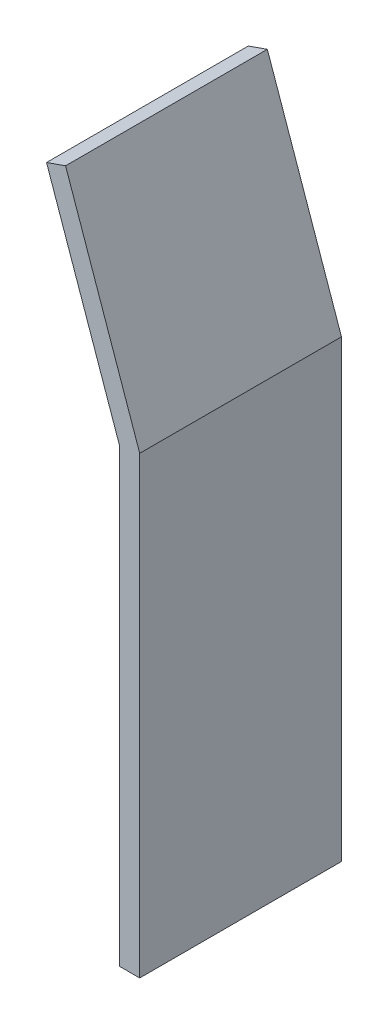
ISO-10303-21;
HEADER;
FILE_DESCRIPTION(('STEP AP214'),'2;1');
FILE_NAME('part.step','',(''),(''),'','','');
FILE_SCHEMA(('AUTOMOTIVE_DESIGN { 1 0 10303 214 1 1 1 1 }'));
ENDSEC;
DATA;
#1=APPLICATION_CONTEXT('core data for automotive mechanical design processes');
#2=APPLICATION_PROTOCOL_DEFINITION('international standard','automotive_design',2000,#1);
#3=PRODUCT_CONTEXT('',#1,'mechanical');
#4=PRODUCT('Part','Part','',(#3));
#5=PRODUCT_RELATED_PRODUCT_CATEGORY('part','',(#4));
#6=PRODUCT_DEFINITION_FORMATION('','',#4);
#7=PRODUCT_DEFINITION_CONTEXT('part definition',#1,'design');
#8=PRODUCT_DEFINITION('design','',#6,#7);
#9=PRODUCT_DEFINITION_SHAPE('','',#8);
#10=(LENGTH_UNIT() NAMED_UNIT(*) SI_UNIT(.MILLI.,.METRE.));
#11=(NAMED_UNIT(*) PLANE_ANGLE_UNIT() SI_UNIT($,.RADIAN.));
#12=(NAMED_UNIT(*) SI_UNIT($,.STERADIAN.) SOLID_ANGLE_UNIT());
#13=UNCERTAINTY_MEASURE_WITH_UNIT(LENGTH_MEASURE(1.E-05),#10,'distance_accuracy_value','');
#14=(GEOMETRIC_REPRESENTATION_CONTEXT(3) GLOBAL_UNCERTAINTY_ASSIGNED_CONTEXT((#13)) GLOBAL_UNIT_ASSIGNED_CONTEXT((#10,
#11,#12)) REPRESENTATION_CONTEXT('',''));
#15=CARTESIAN_POINT('',(0.,0.,0.));
#16=DIRECTION('',(0.,0.,1.));
#17=DIRECTION('',(1.,0.,0.));
#18=AXIS2_PLACEMENT_3D('',#15,#16,#17);
#19=CARTESIAN_POINT('',(-72.3633279223742,206.868688718228,200.));
#20=DIRECTION('',(0.943916265368806,0.330184923902054,0.));
#21=DIRECTION('',(-0.330184923902054,0.943916265368806,0.));
#22=AXIS2_PLACEMENT_3D('',#19,#20,#21);
#23=PLANE('',#22);
#24=DIRECTION('',(0.330184923902054,-0.943916265368806,0.));
#25=VECTOR('',#24,1.);
#26=CARTESIAN_POINT('',(-72.3633279223742,206.868688718228,0.));
#27=LINE('',#26,#25);
#28=CARTESIAN_POINT('',(-72.3633279223742,206.868688718228,0.));
#29=VERTEX_POINT('',#28);
#30=CARTESIAN_POINT('',(0.,0.,0.));
#31=VERTEX_POINT('',#30);
#32=EDGE_CURVE('E134',#29,#31,#27,.T.);
#33=ORIENTED_EDGE('',*,*,#32,.T.);
#34=DIRECTION('',(0.,0.,-1.));
#35=VECTOR('',#34,1.);
#36=CARTESIAN_POINT('',(0.,0.,200.));
#37=LINE('',#36,#35);
#38=CARTESIAN_POINT('',(0.,0.,200.));
#39=VERTEX_POINT('',#38);
#40=EDGE_CURVE('E11',#39,#31,#37,.T.);
#41=ORIENTED_EDGE('',*,*,#40,.F.);
#42=DIRECTION('',(0.330184923902054,-0.943916265368806,0.));
#43=VECTOR('',#42,1.);
#44=CARTESIAN_POINT('',(-72.3633279223742,206.868688718228,200.));
#45=LINE('',#44,#43);
#46=CARTESIAN_POINT('',(-72.3633279223742,206.868688718228,200.));
#47=VERTEX_POINT('',#46);
#48=EDGE_CURVE('E150',#47,#39,#45,.T.);
#49=ORIENTED_EDGE('',*,*,#48,.F.);
#50=DIRECTION('',(0.,0.,-1.));
#51=VECTOR('',#50,1.);
#52=CARTESIAN_POINT('',(-72.3633279223742,206.868688718228,200.));
#53=LINE('',#52,#51);
#54=EDGE_CURVE('E130',#47,#29,#53,.T.);
#55=ORIENTED_EDGE('',*,*,#54,.T.);
#56=EDGE_LOOP('',(#33,#41,#49,#55));
#57=FACE_BOUND('',#56,.T.);
#58=ADVANCED_FACE('F45',(#57),#23,.F.);
#59=CARTESIAN_POINT('',(0.,0.,200.));
#60=DIRECTION('',(1.,0.,0.));
#61=DIRECTION('',(0.,1.,0.));
#62=AXIS2_PLACEMENT_3D('',#59,#60,#61);
#63=PLANE('',#62);
#64=DIRECTION('',(0.,-1.,0.));
#65=VECTOR('',#64,1.);
#66=CARTESIAN_POINT('',(0.,0.,0.));
#67=LINE('',#66,#65);
#68=CARTESIAN_POINT('',(0.,-447.,0.));
#69=VERTEX_POINT('',#68);
#70=EDGE_CURVE('E138',#31,#69,#67,.T.);
#71=ORIENTED_EDGE('',*,*,#70,.T.);
#72=DIRECTION('',(0.,0.,-1.));
#73=VECTOR('',#72,1.);
#74=CARTESIAN_POINT('',(0.,-447.,200.));
#75=LINE('',#74,#73);
#76=CARTESIAN_POINT('',(0.,-447.,200.));
#77=VERTEX_POINT('',#76);
#78=EDGE_CURVE('E54',#77,#69,#75,.T.);
#79=ORIENTED_EDGE('',*,*,#78,.F.);
#80=DIRECTION('',(0.,-1.,0.));
#81=VECTOR('',#80,1.);
#82=CARTESIAN_POINT('',(0.,0.,200.));
#83=LINE('',#82,#81);
#84=EDGE_CURVE('E99',#39,#77,#83,.T.);
#85=ORIENTED_EDGE('',*,*,#84,.F.);
#86=ORIENTED_EDGE('',*,*,#40,.T.);
#87=EDGE_LOOP('',(#71,#79,#85,#86));
#88=FACE_BOUND('',#87,.T.);
#89=ADVANCED_FACE('F178',(#88),#63,.F.);
#90=CARTESIAN_POINT('',(0.,-447.,200.));
#91=DIRECTION('',(0.,1.,0.));
#92=DIRECTION('',(-1.,0.,0.));
#93=AXIS2_PLACEMENT_3D('',#90,#91,#92);
#94=PLANE('',#93);
#95=DIRECTION('',(1.,0.,0.));
#96=VECTOR('',#95,1.);
#97=CARTESIAN_POINT('',(0.,-447.,0.));
#98=LINE('',#97,#96);
#99=CARTESIAN_POINT('',(20.0000000000001,-447.,0.));
#100=VERTEX_POINT('',#99);
#101=EDGE_CURVE('E141',#69,#100,#98,.T.);
#102=ORIENTED_EDGE('',*,*,#101,.T.);
#103=DIRECTION('',(0.,0.,-1.));
#104=VECTOR('',#103,1.);
#105=CARTESIAN_POINT('',(20.0000000000001,-447.,200.));
#106=LINE('',#105,#104);
#107=CARTESIAN_POINT('',(20.0000000000001,-447.,200.));
#108=VERTEX_POINT('',#107);
#109=EDGE_CURVE('E123',#108,#100,#106,.T.);
#110=ORIENTED_EDGE('',*,*,#109,.F.);
#111=DIRECTION('',(1.,0.,0.));
#112=VECTOR('',#111,1.);
#113=CARTESIAN_POINT('',(0.,-447.,200.));
#114=LINE('',#113,#112);
#115=EDGE_CURVE('E112',#77,#108,#114,.T.);
#116=ORIENTED_EDGE('',*,*,#115,.F.);
#117=ORIENTED_EDGE('',*,*,#78,.T.);
#118=EDGE_LOOP('',(#102,#110,#116,#117));
#119=FACE_BOUND('',#118,.T.);
#120=ADVANCED_FACE('F160',(#119),#94,.F.);
#121=CARTESIAN_POINT('',(20.0000000000001,-447.,200.));
#122=DIRECTION('',(-1.,0.,0.));
#123=DIRECTION('',(0.,-1.,0.));
#124=AXIS2_PLACEMENT_3D('',#121,#122,#123);
#125=PLANE('',#124);
#126=DIRECTION('',(0.,1.,0.));
#127=VECTOR('',#126,1.);
#128=CARTESIAN_POINT('',(20.0000000000001,-447.,0.));
#129=LINE('',#128,#127);
#130=CARTESIAN_POINT('',(20.0000000000001,3.39711056267533,0.));
#131=VERTEX_POINT('',#130);
#132=EDGE_CURVE('E121',#100,#131,#129,.T.);
#133=ORIENTED_EDGE('',*,*,#132,.T.);
#134=DIRECTION('',(0.,0.,-1.));
#135=VECTOR('',#134,1.);
#136=CARTESIAN_POINT('',(20.0000000000001,3.39711056267533,200.));
#137=LINE('',#136,#135);
#138=CARTESIAN_POINT('',(20.0000000000001,3.39711056267533,200.));
#139=VERTEX_POINT('',#138);
#140=EDGE_CURVE('E118',#139,#131,#137,.T.);
#141=ORIENTED_EDGE('',*,*,#140,.F.);
#142=DIRECTION('',(0.,1.,0.));
#143=VECTOR('',#142,1.);
#144=CARTESIAN_POINT('',(20.0000000000001,-447.,200.));
#145=LINE('',#144,#143);
#146=EDGE_CURVE('E106',#108,#139,#145,.T.);
#147=ORIENTED_EDGE('',*,*,#146,.F.);
#148=ORIENTED_EDGE('',*,*,#109,.T.);
#149=EDGE_LOOP('',(#133,#141,#147,#148));
#150=FACE_BOUND('',#149,.T.);
#151=ADVANCED_FACE('F119',(#150),#125,.F.);
#152=CARTESIAN_POINT('',(-53.4850026141146,213.472387193743,200.));
#153=DIRECTION('',(-0.943916265368806,-0.330184923902054,0.));
#154=DIRECTION('',(0.330184923902054,-0.943916265368806,0.));
#155=AXIS2_PLACEMENT_3D('',#152,#153,#154);
#156=PLANE('',#155);
#157=DIRECTION('',(-0.330184923902054,0.943916265368806,0.));
#158=VECTOR('',#157,1.);
#159=CARTESIAN_POINT('',(-53.4850026141146,213.472387193743,0.));
#160=LINE('',#159,#158);
#161=CARTESIAN_POINT('',(-53.4850026141146,213.472387193743,0.));
#162=VERTEX_POINT('',#161);
#163=EDGE_CURVE('E85',#131,#162,#160,.T.);
#164=ORIENTED_EDGE('',*,*,#163,.T.);
#165=DIRECTION('',(0.,0.,-1.));
#166=VECTOR('',#165,1.);
#167=CARTESIAN_POINT('',(-53.4850026141146,213.472387193743,200.));
#168=LINE('',#167,#166);
#169=CARTESIAN_POINT('',(-53.4850026141146,213.472387193743,200.));
#170=VERTEX_POINT('',#169);
#171=EDGE_CURVE('E124',#170,#162,#168,.T.);
#172=ORIENTED_EDGE('',*,*,#171,.F.);
#173=DIRECTION('',(-0.330184923902054,0.943916265368806,0.));
#174=VECTOR('',#173,1.);
#175=CARTESIAN_POINT('',(-53.4850026141146,213.472387193743,200.));
#176=LINE('',#175,#174);
#177=EDGE_CURVE('E110',#139,#170,#176,.T.);
#178=ORIENTED_EDGE('',*,*,#177,.F.);
#179=ORIENTED_EDGE('',*,*,#140,.T.);
#180=EDGE_LOOP('',(#164,#172,#178,#179));
#181=FACE_BOUND('',#180,.T.);
#182=ADVANCED_FACE('F126',(#181),#156,.F.);
#183=CARTESIAN_POINT('',(-53.4850026141146,213.472387193743,200.));
#184=DIRECTION('',(0.330184923775774,-0.94391626541298,0.));
#185=DIRECTION('',(0.94391626541298,0.330184923775774,0.));
#186=AXIS2_PLACEMENT_3D('',#183,#184,#185);
#187=PLANE('',#186);
#188=DIRECTION('',(-0.943916265412979,-0.330184923775774,0.));
#189=VECTOR('',#188,1.);
#190=CARTESIAN_POINT('',(-53.4850026141146,213.472387193743,0.));
#191=LINE('',#190,#189);
#192=EDGE_CURVE('E91',#162,#29,#191,.T.);
#193=ORIENTED_EDGE('',*,*,#192,.T.);
#194=ORIENTED_EDGE('',*,*,#54,.F.);
#195=DIRECTION('',(-0.943916265412979,-0.330184923775774,0.));
#196=VECTOR('',#195,1.);
#197=CARTESIAN_POINT('',(-53.4850026141146,213.472387193743,200.));
#198=LINE('',#197,#196);
#199=EDGE_CURVE('E62',#170,#47,#198,.T.);
#200=ORIENTED_EDGE('',*,*,#199,.F.);
#201=ORIENTED_EDGE('',*,*,#171,.T.);
#202=EDGE_LOOP('',(#193,#194,#200,#201));
#203=FACE_BOUND('',#202,.T.);
#204=ADVANCED_FACE('F167',(#203),#187,.F.);
#205=CARTESIAN_POINT('',(0.,0.,200.));
#206=DIRECTION('',(0.,0.,-1.));
#207=DIRECTION('',(-1.,0.,0.));
#208=AXIS2_PLACEMENT_3D('',#205,#206,#207);
#209=PLANE('',#208);
#210=ORIENTED_EDGE('',*,*,#48,.T.);
#211=ORIENTED_EDGE('',*,*,#84,.T.);
#212=ORIENTED_EDGE('',*,*,#115,.T.);
#213=ORIENTED_EDGE('',*,*,#146,.T.);
#214=ORIENTED_EDGE('',*,*,#177,.T.);
#215=ORIENTED_EDGE('',*,*,#199,.T.);
#216=EDGE_LOOP('',(#210,#211,#212,#213,#214,#215));
#217=FACE_BOUND('',#216,.T.);
#218=ADVANCED_FACE('F108',(#217),#209,.F.);
#219=CARTESIAN_POINT('',(0.,0.,0.));
#220=DIRECTION('',(0.,0.,-1.));
#221=DIRECTION('',(-1.,0.,0.));
#222=AXIS2_PLACEMENT_3D('',#219,#220,#221);
#223=PLANE('',#222);
#224=ORIENTED_EDGE('',*,*,#32,.F.);
#225=ORIENTED_EDGE('',*,*,#192,.F.);
#226=ORIENTED_EDGE('',*,*,#163,.F.);
#227=ORIENTED_EDGE('',*,*,#132,.F.);
#228=ORIENTED_EDGE('',*,*,#101,.F.);
#229=ORIENTED_EDGE('',*,*,#70,.F.);
#230=EDGE_LOOP('',(#224,#225,#226,#227,#228,#229));
#231=FACE_BOUND('',#230,.T.);
#232=ADVANCED_FACE('F163',(#231),#223,.T.);
#233=CLOSED_SHELL('',(#58,#89,#120,#151,#182,#204,#218,#232));
#234=MANIFOLD_SOLID_BREP('B2',#233);
#235=ADVANCED_BREP_SHAPE_REPRESENTATION('',(#18,#234),#14);
#236=SHAPE_DEFINITION_REPRESENTATION(#9,#235);
ENDSEC;
END-ISO-10303-21;
